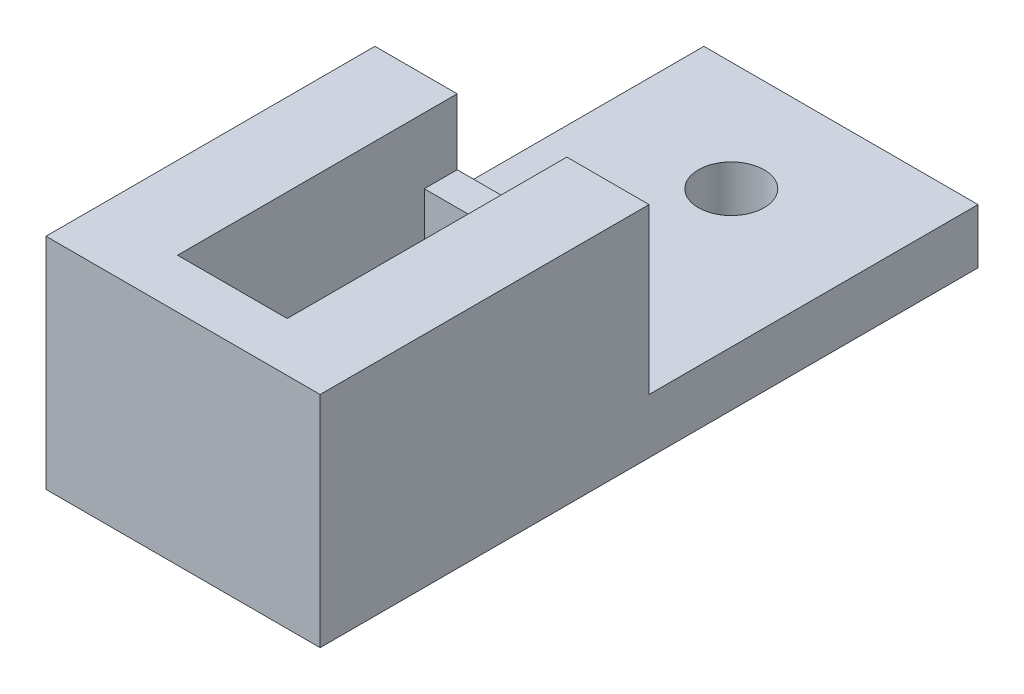
ISO-10303-21;
HEADER;
FILE_DESCRIPTION(('STEP AP214'),'2;1');
FILE_NAME('part.step','',(''),(''),'','','');
FILE_SCHEMA(('AUTOMOTIVE_DESIGN { 1 0 10303 214 1 1 1 1 }'));
ENDSEC;
DATA;
#1=APPLICATION_CONTEXT('core data for automotive mechanical design processes');
#2=APPLICATION_PROTOCOL_DEFINITION('international standard','automotive_design',2000,#1);
#3=PRODUCT_CONTEXT('',#1,'mechanical');
#4=PRODUCT('Part','Part','',(#3));
#5=PRODUCT_RELATED_PRODUCT_CATEGORY('part','',(#4));
#6=PRODUCT_DEFINITION_FORMATION('','',#4);
#7=PRODUCT_DEFINITION_CONTEXT('part definition',#1,'design');
#8=PRODUCT_DEFINITION('design','',#6,#7);
#9=PRODUCT_DEFINITION_SHAPE('','',#8);
#10=(LENGTH_UNIT() NAMED_UNIT(*) SI_UNIT(.MILLI.,.METRE.));
#11=(NAMED_UNIT(*) PLANE_ANGLE_UNIT() SI_UNIT($,.RADIAN.));
#12=(NAMED_UNIT(*) SI_UNIT($,.STERADIAN.) SOLID_ANGLE_UNIT());
#13=UNCERTAINTY_MEASURE_WITH_UNIT(LENGTH_MEASURE(1.E-05),#10,'distance_accuracy_value','');
#14=(GEOMETRIC_REPRESENTATION_CONTEXT(3) GLOBAL_UNCERTAINTY_ASSIGNED_CONTEXT((#13)) GLOBAL_UNIT_ASSIGNED_CONTEXT((#10,
#11,#12)) REPRESENTATION_CONTEXT('',''));
#15=CARTESIAN_POINT('',(0.,0.,0.));
#16=DIRECTION('',(0.,0.,1.));
#17=DIRECTION('',(1.,0.,0.));
#18=AXIS2_PLACEMENT_3D('',#15,#16,#17);
#19=CARTESIAN_POINT('',(6.35,-33.8109262841384,0.));
#20=DIRECTION('',(1.,0.,0.));
#21=DIRECTION('',(0.,0.,-1.));
#22=AXIS2_PLACEMENT_3D('',#19,#20,#21);
#23=PLANE('',#22);
#24=DIRECTION('',(0.,1.,0.));
#25=VECTOR('',#24,1.);
#26=CARTESIAN_POINT('',(6.35,17.78,32.385));
#27=LINE('',#26,#25);
#28=CARTESIAN_POINT('',(6.35,17.78,32.385));
#29=VERTEX_POINT('',#28);
#30=CARTESIAN_POINT('',(6.35,25.4,32.385));
#31=VERTEX_POINT('',#30);
#32=EDGE_CURVE('E208',#29,#31,#27,.T.);
#33=ORIENTED_EDGE('',*,*,#32,.T.);
#34=DIRECTION('',(0.,0.,-1.));
#35=VECTOR('',#34,1.);
#36=CARTESIAN_POINT('',(6.35,25.4,0.));
#37=LINE('',#36,#35);
#38=CARTESIAN_POINT('',(6.35,25.4,0.));
#39=VERTEX_POINT('',#38);
#40=EDGE_CURVE('E239',#31,#39,#37,.T.);
#41=ORIENTED_EDGE('',*,*,#40,.T.);
#42=DIRECTION('',(0.,1.,0.));
#43=VECTOR('',#42,1.);
#44=CARTESIAN_POINT('',(6.35,-33.8109262841384,0.));
#45=LINE('',#44,#43);
#46=CARTESIAN_POINT('',(6.35,17.78,0.));
#47=VERTEX_POINT('',#46);
#48=EDGE_CURVE('E250',#47,#39,#45,.T.);
#49=ORIENTED_EDGE('',*,*,#48,.F.);
#50=DIRECTION('',(0.,0.,-1.));
#51=VECTOR('',#50,1.);
#52=CARTESIAN_POINT('',(6.35,17.78,3.80999999999999));
#53=LINE('',#52,#51);
#54=CARTESIAN_POINT('',(6.35,17.78,3.80999999999999));
#55=VERTEX_POINT('',#54);
#56=EDGE_CURVE('E211',#55,#47,#53,.T.);
#57=ORIENTED_EDGE('',*,*,#56,.F.);
#58=DIRECTION('',(0.,1.,0.));
#59=VECTOR('',#58,1.);
#60=CARTESIAN_POINT('',(6.35,0.,3.80999999999999));
#61=LINE('',#60,#59);
#62=CARTESIAN_POINT('',(6.35,0.,3.80999999999999));
#63=VERTEX_POINT('',#62);
#64=EDGE_CURVE('E240',#63,#55,#61,.T.);
#65=ORIENTED_EDGE('',*,*,#64,.F.);
#66=DIRECTION('',(0.,0.,-1.));
#67=VECTOR('',#66,1.);
#68=CARTESIAN_POINT('',(6.35,0.,3.80999999999999));
#69=LINE('',#68,#67);
#70=CARTESIAN_POINT('',(6.35,0.,32.385));
#71=VERTEX_POINT('',#70);
#72=EDGE_CURVE('E60',#71,#63,#69,.T.);
#73=ORIENTED_EDGE('',*,*,#72,.F.);
#74=DIRECTION('',(0.,1.,0.));
#75=VECTOR('',#74,1.);
#76=CARTESIAN_POINT('',(6.35,0.,32.385));
#77=LINE('',#76,#75);
#78=CARTESIAN_POINT('',(6.35,11.43,32.385));
#79=VERTEX_POINT('',#78);
#80=EDGE_CURVE('E243',#71,#79,#77,.T.);
#81=ORIENTED_EDGE('',*,*,#80,.T.);
#82=DIRECTION('',(0.,0.,-1.));
#83=VECTOR('',#82,1.);
#84=CARTESIAN_POINT('',(6.35,11.43,32.385));
#85=LINE('',#84,#83);
#86=CARTESIAN_POINT('',(6.35,11.43,27.305));
#87=VERTEX_POINT('',#86);
#88=EDGE_CURVE('E201',#79,#87,#85,.T.);
#89=ORIENTED_EDGE('',*,*,#88,.T.);
#90=DIRECTION('',(0.,1.,0.));
#91=VECTOR('',#90,1.);
#92=CARTESIAN_POINT('',(6.35,17.78,27.305));
#93=LINE('',#92,#91);
#94=CARTESIAN_POINT('',(6.35,17.78,27.305));
#95=VERTEX_POINT('',#94);
#96=EDGE_CURVE('E205',#87,#95,#93,.T.);
#97=ORIENTED_EDGE('',*,*,#96,.T.);
#98=DIRECTION('',(0.,0.,1.));
#99=VECTOR('',#98,1.);
#100=CARTESIAN_POINT('',(6.35,17.78,32.385));
#101=LINE('',#100,#99);
#102=EDGE_CURVE('E174',#95,#29,#101,.T.);
#103=ORIENTED_EDGE('',*,*,#102,.T.);
#104=EDGE_LOOP('',(#33,#41,#49,#57,#65,#73,#81,#89,#97,#103));
#105=FACE_BOUND('',#104,.T.);
#106=ADVANCED_FACE('F45',(#105),#23,.F.);
#107=CARTESIAN_POINT('',(-6.35,-33.8109262841384,0.));
#108=DIRECTION('',(-1.,0.,0.));
#109=DIRECTION('',(0.,0.,1.));
#110=AXIS2_PLACEMENT_3D('',#107,#108,#109);
#111=PLANE('',#110);
#112=DIRECTION('',(0.,1.,0.));
#113=VECTOR('',#112,1.);
#114=CARTESIAN_POINT('',(-6.35,17.78,32.385));
#115=LINE('',#114,#113);
#116=CARTESIAN_POINT('',(-6.35,17.78,32.385));
#117=VERTEX_POINT('',#116);
#118=CARTESIAN_POINT('',(-6.35,25.4,32.385));
#119=VERTEX_POINT('',#118);
#120=EDGE_CURVE('E190',#117,#119,#115,.T.);
#121=ORIENTED_EDGE('',*,*,#120,.F.);
#122=DIRECTION('',(0.,0.,1.));
#123=VECTOR('',#122,1.);
#124=CARTESIAN_POINT('',(-6.35,17.78,32.385));
#125=LINE('',#124,#123);
#126=CARTESIAN_POINT('',(-6.35,17.78,27.305));
#127=VERTEX_POINT('',#126);
#128=EDGE_CURVE('E171',#127,#117,#125,.T.);
#129=ORIENTED_EDGE('',*,*,#128,.F.);
#130=DIRECTION('',(0.,1.,0.));
#131=VECTOR('',#130,1.);
#132=CARTESIAN_POINT('',(-6.35,17.78,27.305));
#133=LINE('',#132,#131);
#134=CARTESIAN_POINT('',(-6.35,11.43,27.305));
#135=VERTEX_POINT('',#134);
#136=EDGE_CURVE('E181',#135,#127,#133,.T.);
#137=ORIENTED_EDGE('',*,*,#136,.F.);
#138=DIRECTION('',(0.,0.,-1.));
#139=VECTOR('',#138,1.);
#140=CARTESIAN_POINT('',(-6.35,11.43,32.385));
#141=LINE('',#140,#139);
#142=CARTESIAN_POINT('',(-6.35,11.43,32.385));
#143=VERTEX_POINT('',#142);
#144=EDGE_CURVE('E186',#143,#135,#141,.T.);
#145=ORIENTED_EDGE('',*,*,#144,.F.);
#146=DIRECTION('',(0.,1.,0.));
#147=VECTOR('',#146,1.);
#148=CARTESIAN_POINT('',(-6.34999999999999,0.,32.385));
#149=LINE('',#148,#147);
#150=CARTESIAN_POINT('',(-6.34999999999999,0.,32.385));
#151=VERTEX_POINT('',#150);
#152=EDGE_CURVE('E236',#151,#143,#149,.T.);
#153=ORIENTED_EDGE('',*,*,#152,.F.);
#154=DIRECTION('',(0.,0.,1.));
#155=VECTOR('',#154,1.);
#156=CARTESIAN_POINT('',(-6.34999999999999,0.,3.80999999999999));
#157=LINE('',#156,#155);
#158=CARTESIAN_POINT('',(-6.34999999999999,0.,3.80999999999999));
#159=VERTEX_POINT('',#158);
#160=EDGE_CURVE('E226',#159,#151,#157,.T.);
#161=ORIENTED_EDGE('',*,*,#160,.F.);
#162=DIRECTION('',(0.,1.,0.));
#163=VECTOR('',#162,1.);
#164=CARTESIAN_POINT('',(-6.34999999999999,0.,3.80999999999999));
#165=LINE('',#164,#163);
#166=CARTESIAN_POINT('',(-6.35,17.78,3.80999999999999));
#167=VERTEX_POINT('',#166);
#168=EDGE_CURVE('E237',#159,#167,#165,.T.);
#169=ORIENTED_EDGE('',*,*,#168,.T.);
#170=DIRECTION('',(0.,0.,1.));
#171=VECTOR('',#170,1.);
#172=CARTESIAN_POINT('',(-6.35,17.78,3.80999999999999));
#173=LINE('',#172,#171);
#174=CARTESIAN_POINT('',(-6.35,17.78,0.));
#175=VERTEX_POINT('',#174);
#176=EDGE_CURVE('E218',#175,#167,#173,.T.);
#177=ORIENTED_EDGE('',*,*,#176,.F.);
#178=DIRECTION('',(0.,1.,0.));
#179=VECTOR('',#178,1.);
#180=CARTESIAN_POINT('',(-6.35,-33.8109262841384,0.));
#181=LINE('',#180,#179);
#182=CARTESIAN_POINT('',(-6.35,25.4,0.));
#183=VERTEX_POINT('',#182);
#184=EDGE_CURVE('E68',#175,#183,#181,.T.);
#185=ORIENTED_EDGE('',*,*,#184,.T.);
#186=DIRECTION('',(0.,0.,1.));
#187=VECTOR('',#186,1.);
#188=CARTESIAN_POINT('',(-6.35,25.4,0.));
#189=LINE('',#188,#187);
#190=EDGE_CURVE('E248',#183,#119,#189,.T.);
#191=ORIENTED_EDGE('',*,*,#190,.T.);
#192=EDGE_LOOP('',(#121,#129,#137,#145,#153,#161,#169,#177,#185,#191));
#193=FACE_BOUND('',#192,.T.);
#194=ADVANCED_FACE('F188',(#193),#111,.F.);
#195=CARTESIAN_POINT('',(0.,6.35,0.));
#196=DIRECTION('',(0.,1.,0.));
#197=DIRECTION('',(0.,0.,1.));
#198=AXIS2_PLACEMENT_3D('',#195,#196,#197);
#199=PLANE('',#198);
#200=CARTESIAN_POINT('',(0.,6.35,-25.4));
#201=DIRECTION('',(0.,1.,0.));
#202=DIRECTION('',(0.,0.,1.));
#203=AXIS2_PLACEMENT_3D('',#200,#201,#202);
#204=CIRCLE('',#203,3.81);
#205=CARTESIAN_POINT('',(0.,6.35,-21.59));
#206=VERTEX_POINT('',#205);
#207=EDGE_CURVE('E280',#206,#206,#204,.T.);
#208=ORIENTED_EDGE('',*,*,#207,.F.);
#209=EDGE_LOOP('',(#208));
#210=FACE_BOUND('',#209,.T.);
#211=DIRECTION('',(0.,0.,1.));
#212=VECTOR('',#211,1.);
#213=CARTESIAN_POINT('',(-15.875,6.35,-38.1));
#214=LINE('',#213,#212);
#215=CARTESIAN_POINT('',(-15.875,6.35,-38.1));
#216=VERTEX_POINT('',#215);
#217=CARTESIAN_POINT('',(-15.875,6.35,0.));
#218=VERTEX_POINT('',#217);
#219=EDGE_CURVE('E293',#216,#218,#214,.T.);
#220=ORIENTED_EDGE('',*,*,#219,.T.);
#221=DIRECTION('',(-1.,0.,0.));
#222=VECTOR('',#221,1.);
#223=CARTESIAN_POINT('',(-15.875,6.35,0.));
#224=LINE('',#223,#222);
#225=CARTESIAN_POINT('',(15.875,6.35,0.));
#226=VERTEX_POINT('',#225);
#227=EDGE_CURVE('E253',#226,#218,#224,.T.);
#228=ORIENTED_EDGE('',*,*,#227,.F.);
#229=DIRECTION('',(0.,0.,-1.));
#230=VECTOR('',#229,1.);
#231=CARTESIAN_POINT('',(15.875,6.35,-38.1));
#232=LINE('',#231,#230);
#233=CARTESIAN_POINT('',(15.875,6.35,-38.1));
#234=VERTEX_POINT('',#233);
#235=EDGE_CURVE('E287',#226,#234,#232,.T.);
#236=ORIENTED_EDGE('',*,*,#235,.T.);
#237=DIRECTION('',(-1.,0.,0.));
#238=VECTOR('',#237,1.);
#239=CARTESIAN_POINT('',(-15.875,6.35,-38.1));
#240=LINE('',#239,#238);
#241=EDGE_CURVE('E290',#234,#216,#240,.T.);
#242=ORIENTED_EDGE('',*,*,#241,.T.);
#243=EDGE_LOOP('',(#220,#228,#236,#242));
#244=FACE_BOUND('',#243,.T.);
#245=ADVANCED_FACE('F342',(#210,#244),#199,.T.);
#246=CARTESIAN_POINT('',(15.875,6.35,-38.1));
#247=DIRECTION('',(-1.,0.,0.));
#248=DIRECTION('',(0.,0.,1.));
#249=AXIS2_PLACEMENT_3D('',#246,#247,#248);
#250=PLANE('',#249);
#251=DIRECTION('',(0.,0.,-1.));
#252=VECTOR('',#251,1.);
#253=CARTESIAN_POINT('',(15.875,0.,-38.1));
#254=LINE('',#253,#252);
#255=CARTESIAN_POINT('',(15.875,0.,38.1));
#256=VERTEX_POINT('',#255);
#257=CARTESIAN_POINT('',(15.875,0.,-38.1));
#258=VERTEX_POINT('',#257);
#259=EDGE_CURVE('E284',#256,#258,#254,.T.);
#260=ORIENTED_EDGE('',*,*,#259,.T.);
#261=DIRECTION('',(0.,-1.,0.));
#262=VECTOR('',#261,1.);
#263=CARTESIAN_POINT('',(15.875,6.35,-38.1));
#264=LINE('',#263,#262);
#265=EDGE_CURVE('E11',#234,#258,#264,.T.);
#266=ORIENTED_EDGE('',*,*,#265,.F.);
#267=ORIENTED_EDGE('',*,*,#235,.F.);
#268=DIRECTION('',(0.,-1.,0.));
#269=VECTOR('',#268,1.);
#270=CARTESIAN_POINT('',(15.875,25.4,0.));
#271=LINE('',#270,#269);
#272=CARTESIAN_POINT('',(15.875,25.4,0.));
#273=VERTEX_POINT('',#272);
#274=EDGE_CURVE('E276',#273,#226,#271,.T.);
#275=ORIENTED_EDGE('',*,*,#274,.F.);
#276=DIRECTION('',(0.,0.,-1.));
#277=VECTOR('',#276,1.);
#278=CARTESIAN_POINT('',(15.875,25.4,38.1));
#279=LINE('',#278,#277);
#280=CARTESIAN_POINT('',(15.875,25.4,38.1));
#281=VERTEX_POINT('',#280);
#282=EDGE_CURVE('E262',#281,#273,#279,.T.);
#283=ORIENTED_EDGE('',*,*,#282,.F.);
#284=DIRECTION('',(0.,-1.,0.));
#285=VECTOR('',#284,1.);
#286=CARTESIAN_POINT('',(15.875,6.35,38.1));
#287=LINE('',#286,#285);
#288=EDGE_CURVE('E297',#281,#256,#287,.T.);
#289=ORIENTED_EDGE('',*,*,#288,.T.);
#290=EDGE_LOOP('',(#260,#266,#267,#275,#283,#289));
#291=FACE_BOUND('',#290,.T.);
#292=ADVANCED_FACE('F47',(#291),#250,.F.);
#293=CARTESIAN_POINT('',(-15.875,6.35,-38.1));
#294=DIRECTION('',(0.,0.,1.));
#295=DIRECTION('',(1.,0.,0.));
#296=AXIS2_PLACEMENT_3D('',#293,#294,#295);
#297=PLANE('',#296);
#298=DIRECTION('',(-1.,0.,0.));
#299=VECTOR('',#298,1.);
#300=CARTESIAN_POINT('',(-15.875,0.,-38.1));
#301=LINE('',#300,#299);
#302=CARTESIAN_POINT('',(-15.875,0.,-38.1));
#303=VERTEX_POINT('',#302);
#304=EDGE_CURVE('E301',#258,#303,#301,.T.);
#305=ORIENTED_EDGE('',*,*,#304,.T.);
#306=DIRECTION('',(0.,-1.,0.));
#307=VECTOR('',#306,1.);
#308=CARTESIAN_POINT('',(-15.875,6.35,-38.1));
#309=LINE('',#308,#307);
#310=EDGE_CURVE('E53',#216,#303,#309,.T.);
#311=ORIENTED_EDGE('',*,*,#310,.F.);
#312=ORIENTED_EDGE('',*,*,#241,.F.);
#313=ORIENTED_EDGE('',*,*,#265,.T.);
#314=EDGE_LOOP('',(#305,#311,#312,#313));
#315=FACE_BOUND('',#314,.T.);
#316=ADVANCED_FACE('F343',(#315),#297,.F.);
#317=CARTESIAN_POINT('',(-15.875,6.35,-38.1));
#318=DIRECTION('',(1.,0.,0.));
#319=DIRECTION('',(0.,0.,-1.));
#320=AXIS2_PLACEMENT_3D('',#317,#318,#319);
#321=PLANE('',#320);
#322=DIRECTION('',(0.,0.,1.));
#323=VECTOR('',#322,1.);
#324=CARTESIAN_POINT('',(-15.875,0.,-38.1));
#325=LINE('',#324,#323);
#326=CARTESIAN_POINT('',(-15.875,0.,38.1));
#327=VERTEX_POINT('',#326);
#328=EDGE_CURVE('E303',#303,#327,#325,.T.);
#329=ORIENTED_EDGE('',*,*,#328,.T.);
#330=DIRECTION('',(0.,-1.,0.));
#331=VECTOR('',#330,1.);
#332=CARTESIAN_POINT('',(-15.875,6.35,38.1));
#333=LINE('',#332,#331);
#334=CARTESIAN_POINT('',(-15.875,25.4,38.1));
#335=VERTEX_POINT('',#334);
#336=EDGE_CURVE('E309',#335,#327,#333,.T.);
#337=ORIENTED_EDGE('',*,*,#336,.F.);
#338=DIRECTION('',(0.,0.,1.));
#339=VECTOR('',#338,1.);
#340=CARTESIAN_POINT('',(-15.875,25.4,38.1));
#341=LINE('',#340,#339);
#342=CARTESIAN_POINT('',(-15.875,25.4,0.));
#343=VERTEX_POINT('',#342);
#344=EDGE_CURVE('E257',#343,#335,#341,.T.);
#345=ORIENTED_EDGE('',*,*,#344,.F.);
#346=DIRECTION('',(0.,-1.,0.));
#347=VECTOR('',#346,1.);
#348=CARTESIAN_POINT('',(-15.875,25.4,0.));
#349=LINE('',#348,#347);
#350=EDGE_CURVE('E270',#343,#218,#349,.T.);
#351=ORIENTED_EDGE('',*,*,#350,.T.);
#352=ORIENTED_EDGE('',*,*,#219,.F.);
#353=ORIENTED_EDGE('',*,*,#310,.T.);
#354=EDGE_LOOP('',(#329,#337,#345,#351,#352,#353));
#355=FACE_BOUND('',#354,.T.);
#356=ADVANCED_FACE('F316',(#355),#321,.F.);
#357=CARTESIAN_POINT('',(-15.875,6.35,38.1));
#358=DIRECTION('',(0.,0.,-1.));
#359=DIRECTION('',(-1.,0.,0.));
#360=AXIS2_PLACEMENT_3D('',#357,#358,#359);
#361=PLANE('',#360);
#362=ORIENTED_EDGE('',*,*,#288,.F.);
#363=DIRECTION('',(1.,0.,0.));
#364=VECTOR('',#363,1.);
#365=CARTESIAN_POINT('',(-15.875,25.4,38.1));
#366=LINE('',#365,#364);
#367=EDGE_CURVE('E260',#335,#281,#366,.T.);
#368=ORIENTED_EDGE('',*,*,#367,.F.);
#369=ORIENTED_EDGE('',*,*,#336,.T.);
#370=DIRECTION('',(1.,0.,0.));
#371=VECTOR('',#370,1.);
#372=CARTESIAN_POINT('',(-15.875,0.,38.1));
#373=LINE('',#372,#371);
#374=EDGE_CURVE('E291',#327,#256,#373,.T.);
#375=ORIENTED_EDGE('',*,*,#374,.T.);
#376=EDGE_LOOP('',(#362,#368,#369,#375));
#377=FACE_BOUND('',#376,.T.);
#378=ADVANCED_FACE('F325',(#377),#361,.F.);
#379=CARTESIAN_POINT('',(0.,0.,0.));
#380=DIRECTION('',(0.,1.,0.));
#381=DIRECTION('',(0.,0.,1.));
#382=AXIS2_PLACEMENT_3D('',#379,#380,#381);
#383=PLANE('',#382);
#384=DIRECTION('',(-1.,0.,0.));
#385=VECTOR('',#384,1.);
#386=CARTESIAN_POINT('',(-6.34999999999999,0.,3.80999999999999));
#387=LINE('',#386,#385);
#388=EDGE_CURVE('E233',#63,#159,#387,.T.);
#389=ORIENTED_EDGE('',*,*,#388,.T.);
#390=ORIENTED_EDGE('',*,*,#160,.T.);
#391=DIRECTION('',(1.,0.,0.));
#392=VECTOR('',#391,1.);
#393=CARTESIAN_POINT('',(-6.34999999999999,0.,32.385));
#394=LINE('',#393,#392);
#395=EDGE_CURVE('E229',#151,#71,#394,.T.);
#396=ORIENTED_EDGE('',*,*,#395,.T.);
#397=ORIENTED_EDGE('',*,*,#72,.T.);
#398=EDGE_LOOP('',(#389,#390,#396,#397));
#399=FACE_BOUND('',#398,.T.);
#400=CARTESIAN_POINT('',(0.,0.,-25.4));
#401=DIRECTION('',(0.,1.,0.));
#402=DIRECTION('',(0.,0.,1.));
#403=AXIS2_PLACEMENT_3D('',#400,#401,#402);
#404=CIRCLE('',#403,3.81);
#405=CARTESIAN_POINT('',(0.,0.,-21.59));
#406=VERTEX_POINT('',#405);
#407=EDGE_CURVE('E281',#406,#406,#404,.T.);
#408=ORIENTED_EDGE('',*,*,#407,.T.);
#409=EDGE_LOOP('',(#408));
#410=FACE_BOUND('',#409,.T.);
#411=ORIENTED_EDGE('',*,*,#259,.F.);
#412=ORIENTED_EDGE('',*,*,#374,.F.);
#413=ORIENTED_EDGE('',*,*,#328,.F.);
#414=ORIENTED_EDGE('',*,*,#304,.F.);
#415=EDGE_LOOP('',(#411,#412,#413,#414));
#416=FACE_BOUND('',#415,.T.);
#417=ADVANCED_FACE('F322',(#399,#410,#416),#383,.F.);
#418=CARTESIAN_POINT('',(0.,0.,-25.4));
#419=DIRECTION('',(0.,1.,0.));
#420=DIRECTION('',(0.,0.,1.));
#421=AXIS2_PLACEMENT_3D('',#418,#419,#420);
#422=CYLINDRICAL_SURFACE('',#421,3.81);
#423=ORIENTED_EDGE('',*,*,#407,.F.);
#424=EDGE_LOOP('',(#423));
#425=FACE_BOUND('',#424,.T.);
#426=ORIENTED_EDGE('',*,*,#207,.T.);
#427=EDGE_LOOP('',(#426));
#428=FACE_BOUND('',#427,.T.);
#429=ADVANCED_FACE('F363',(#425,#428),#422,.F.);
#430=CARTESIAN_POINT('',(-15.875,25.4,0.));
#431=DIRECTION('',(0.,0.,1.));
#432=DIRECTION('',(1.,0.,0.));
#433=AXIS2_PLACEMENT_3D('',#430,#431,#432);
#434=PLANE('',#433);
#435=DIRECTION('',(-1.,0.,0.));
#436=VECTOR('',#435,1.);
#437=CARTESIAN_POINT('',(-15.875,25.4,0.));
#438=LINE('',#437,#436);
#439=EDGE_CURVE('E265',#183,#343,#438,.T.);
#440=ORIENTED_EDGE('',*,*,#439,.F.);
#441=ORIENTED_EDGE('',*,*,#184,.F.);
#442=DIRECTION('',(-1.,0.,0.));
#443=VECTOR('',#442,1.);
#444=CARTESIAN_POINT('',(6.35,17.78,0.));
#445=LINE('',#444,#443);
#446=EDGE_CURVE('E215',#47,#175,#445,.T.);
#447=ORIENTED_EDGE('',*,*,#446,.F.);
#448=ORIENTED_EDGE('',*,*,#48,.T.);
#449=EDGE_CURVE('E266',#273,#39,#438,.T.);
#450=ORIENTED_EDGE('',*,*,#449,.F.);
#451=ORIENTED_EDGE('',*,*,#274,.T.);
#452=ORIENTED_EDGE('',*,*,#227,.T.);
#453=ORIENTED_EDGE('',*,*,#350,.F.);
#454=EDGE_LOOP('',(#440,#441,#447,#448,#450,#451,#452,#453));
#455=FACE_BOUND('',#454,.T.);
#456=ADVANCED_FACE('F340',(#455),#434,.F.);
#457=CARTESIAN_POINT('',(0.,25.4,0.));
#458=DIRECTION('',(0.,-1.,0.));
#459=DIRECTION('',(0.,0.,-1.));
#460=AXIS2_PLACEMENT_3D('',#457,#458,#459);
#461=PLANE('',#460);
#462=ORIENTED_EDGE('',*,*,#367,.T.);
#463=ORIENTED_EDGE('',*,*,#282,.T.);
#464=ORIENTED_EDGE('',*,*,#449,.T.);
#465=ORIENTED_EDGE('',*,*,#40,.F.);
#466=DIRECTION('',(-1.,0.,0.));
#467=VECTOR('',#466,1.);
#468=CARTESIAN_POINT('',(15.877,25.4,32.385));
#469=LINE('',#468,#467);
#470=EDGE_CURVE('E198',#31,#119,#469,.T.);
#471=ORIENTED_EDGE('',*,*,#470,.T.);
#472=ORIENTED_EDGE('',*,*,#190,.F.);
#473=ORIENTED_EDGE('',*,*,#439,.T.);
#474=ORIENTED_EDGE('',*,*,#344,.T.);
#475=EDGE_LOOP('',(#462,#463,#464,#465,#471,#472,#473,#474));
#476=FACE_BOUND('',#475,.T.);
#477=ADVANCED_FACE('F334',(#476),#461,.F.);
#478=CARTESIAN_POINT('',(-6.34999999999999,0.,3.80999999999999));
#479=DIRECTION('',(0.,0.,-1.));
#480=DIRECTION('',(-1.,0.,0.));
#481=AXIS2_PLACEMENT_3D('',#478,#479,#480);
#482=PLANE('',#481);
#483=ORIENTED_EDGE('',*,*,#64,.T.);
#484=DIRECTION('',(1.,0.,0.));
#485=VECTOR('',#484,1.);
#486=CARTESIAN_POINT('',(6.35,17.78,3.80999999999999));
#487=LINE('',#486,#485);
#488=EDGE_CURVE('E222',#167,#55,#487,.T.);
#489=ORIENTED_EDGE('',*,*,#488,.F.);
#490=ORIENTED_EDGE('',*,*,#168,.F.);
#491=ORIENTED_EDGE('',*,*,#388,.F.);
#492=EDGE_LOOP('',(#483,#489,#490,#491));
#493=FACE_BOUND('',#492,.T.);
#494=ADVANCED_FACE('F360',(#493),#482,.F.);
#495=CARTESIAN_POINT('',(-6.34999999999999,0.,32.385));
#496=DIRECTION('',(0.,0.,1.));
#497=DIRECTION('',(1.,0.,0.));
#498=AXIS2_PLACEMENT_3D('',#495,#496,#497);
#499=PLANE('',#498);
#500=ORIENTED_EDGE('',*,*,#152,.T.);
#501=DIRECTION('',(-1.,0.,0.));
#502=VECTOR('',#501,1.);
#503=CARTESIAN_POINT('',(15.877,11.43,32.385));
#504=LINE('',#503,#502);
#505=EDGE_CURVE('E192',#79,#143,#504,.T.);
#506=ORIENTED_EDGE('',*,*,#505,.F.);
#507=ORIENTED_EDGE('',*,*,#80,.F.);
#508=ORIENTED_EDGE('',*,*,#395,.F.);
#509=EDGE_LOOP('',(#500,#506,#507,#508));
#510=FACE_BOUND('',#509,.T.);
#511=ADVANCED_FACE('F400',(#510),#499,.F.);
#512=CARTESIAN_POINT('',(0.,17.78,0.));
#513=DIRECTION('',(0.,1.,0.));
#514=DIRECTION('',(0.,0.,1.));
#515=AXIS2_PLACEMENT_3D('',#512,#513,#514);
#516=PLANE('',#515);
#517=ORIENTED_EDGE('',*,*,#56,.T.);
#518=ORIENTED_EDGE('',*,*,#446,.T.);
#519=ORIENTED_EDGE('',*,*,#176,.T.);
#520=ORIENTED_EDGE('',*,*,#488,.T.);
#521=EDGE_LOOP('',(#517,#518,#519,#520));
#522=FACE_BOUND('',#521,.T.);
#523=ADVANCED_FACE('F408',(#522),#516,.T.);
#524=CARTESIAN_POINT('',(15.877,17.78,32.385));
#525=DIRECTION('',(0.,0.,1.));
#526=DIRECTION('',(1.,0.,0.));
#527=AXIS2_PLACEMENT_3D('',#524,#525,#526);
#528=PLANE('',#527);
#529=ORIENTED_EDGE('',*,*,#32,.F.);
#530=DIRECTION('',(-1.,0.,0.));
#531=VECTOR('',#530,1.);
#532=CARTESIAN_POINT('',(15.877,17.78,32.385));
#533=LINE('',#532,#531);
#534=EDGE_CURVE('E178',#29,#117,#533,.T.);
#535=ORIENTED_EDGE('',*,*,#534,.T.);
#536=ORIENTED_EDGE('',*,*,#120,.T.);
#537=ORIENTED_EDGE('',*,*,#470,.F.);
#538=EDGE_LOOP('',(#529,#535,#536,#537));
#539=FACE_BOUND('',#538,.T.);
#540=ADVANCED_FACE('F415',(#539),#528,.F.);
#541=CARTESIAN_POINT('',(15.877,17.78,32.385));
#542=DIRECTION('',(0.,-1.,0.));
#543=DIRECTION('',(0.,0.,-1.));
#544=AXIS2_PLACEMENT_3D('',#541,#542,#543);
#545=PLANE('',#544);
#546=ORIENTED_EDGE('',*,*,#102,.F.);
#547=DIRECTION('',(-1.,0.,0.));
#548=VECTOR('',#547,1.);
#549=CARTESIAN_POINT('',(15.877,17.78,27.305));
#550=LINE('',#549,#548);
#551=EDGE_CURVE('E166',#95,#127,#550,.T.);
#552=ORIENTED_EDGE('',*,*,#551,.T.);
#553=ORIENTED_EDGE('',*,*,#128,.T.);
#554=ORIENTED_EDGE('',*,*,#534,.F.);
#555=EDGE_LOOP('',(#546,#552,#553,#554));
#556=FACE_BOUND('',#555,.T.);
#557=ADVANCED_FACE('F168',(#556),#545,.F.);
#558=CARTESIAN_POINT('',(15.877,11.43,32.385));
#559=DIRECTION('',(0.,1.,0.));
#560=DIRECTION('',(0.,0.,1.));
#561=AXIS2_PLACEMENT_3D('',#558,#559,#560);
#562=PLANE('',#561);
#563=ORIENTED_EDGE('',*,*,#88,.F.);
#564=ORIENTED_EDGE('',*,*,#505,.T.);
#565=ORIENTED_EDGE('',*,*,#144,.T.);
#566=DIRECTION('',(-1.,0.,0.));
#567=VECTOR('',#566,1.);
#568=CARTESIAN_POINT('',(15.877,11.43,27.305));
#569=LINE('',#568,#567);
#570=EDGE_CURVE('E177',#87,#135,#569,.T.);
#571=ORIENTED_EDGE('',*,*,#570,.F.);
#572=EDGE_LOOP('',(#563,#564,#565,#571));
#573=FACE_BOUND('',#572,.T.);
#574=ADVANCED_FACE('F430',(#573),#562,.F.);
#575=CARTESIAN_POINT('',(15.877,17.78,27.305));
#576=DIRECTION('',(0.,0.,1.));
#577=DIRECTION('',(1.,0.,0.));
#578=AXIS2_PLACEMENT_3D('',#575,#576,#577);
#579=PLANE('',#578);
#580=ORIENTED_EDGE('',*,*,#96,.F.);
#581=ORIENTED_EDGE('',*,*,#570,.T.);
#582=ORIENTED_EDGE('',*,*,#136,.T.);
#583=ORIENTED_EDGE('',*,*,#551,.F.);
#584=EDGE_LOOP('',(#580,#581,#582,#583));
#585=FACE_BOUND('',#584,.T.);
#586=ADVANCED_FACE('F182',(#585),#579,.F.);
#587=CLOSED_SHELL('',(#106,#194,#245,#292,#316,#356,#378,#417,#429,#456,#477,#494,#511,#523,
#540,#557,#574,#586));
#588=MANIFOLD_SOLID_BREP('B2',#587);
#589=ADVANCED_BREP_SHAPE_REPRESENTATION('',(#18,#588),#14);
#590=SHAPE_DEFINITION_REPRESENTATION(#9,#589);
ENDSEC;
END-ISO-10303-21;
